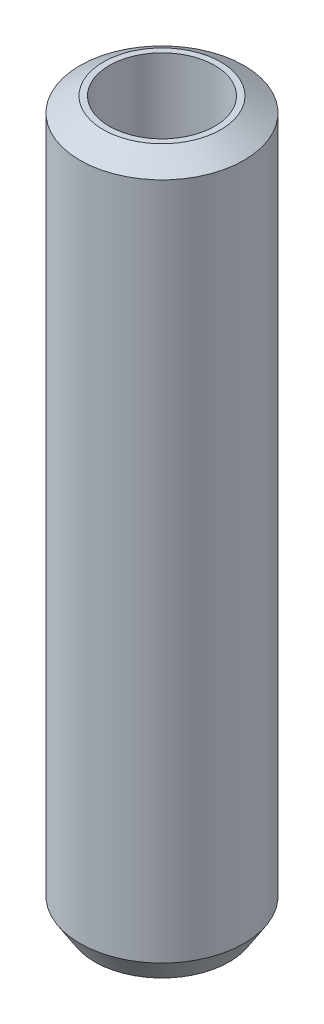
ISO-10303-21;
HEADER;
FILE_DESCRIPTION(('STEP AP214'),'2;1');
FILE_NAME('part.step','',(''),(''),'','','');
FILE_SCHEMA(('AUTOMOTIVE_DESIGN { 1 0 10303 214 1 1 1 1 }'));
ENDSEC;
DATA;
#1=APPLICATION_CONTEXT('core data for automotive mechanical design processes');
#2=APPLICATION_PROTOCOL_DEFINITION('international standard','automotive_design',2000,#1);
#3=PRODUCT_CONTEXT('',#1,'mechanical');
#4=PRODUCT('Part','Part','',(#3));
#5=PRODUCT_RELATED_PRODUCT_CATEGORY('part','',(#4));
#6=PRODUCT_DEFINITION_FORMATION('','',#4);
#7=PRODUCT_DEFINITION_CONTEXT('part definition',#1,'design');
#8=PRODUCT_DEFINITION('design','',#6,#7);
#9=PRODUCT_DEFINITION_SHAPE('','',#8);
#10=(LENGTH_UNIT() NAMED_UNIT(*) SI_UNIT(.MILLI.,.METRE.));
#11=(NAMED_UNIT(*) PLANE_ANGLE_UNIT() SI_UNIT($,.RADIAN.));
#12=(NAMED_UNIT(*) SI_UNIT($,.STERADIAN.) SOLID_ANGLE_UNIT());
#13=UNCERTAINTY_MEASURE_WITH_UNIT(LENGTH_MEASURE(1.E-05),#10,'distance_accuracy_value','');
#14=(GEOMETRIC_REPRESENTATION_CONTEXT(3) GLOBAL_UNCERTAINTY_ASSIGNED_CONTEXT((#13)) GLOBAL_UNIT_ASSIGNED_CONTEXT((#10,
#11,#12)) REPRESENTATION_CONTEXT('',''));
#15=CARTESIAN_POINT('',(0.,0.,0.));
#16=DIRECTION('',(0.,0.,1.));
#17=DIRECTION('',(1.,0.,0.));
#18=AXIS2_PLACEMENT_3D('',#15,#16,#17);
#19=CARTESIAN_POINT('',(0.,261.867297198453,0.));
#20=DIRECTION('',(0.,-1.,0.));
#21=DIRECTION('',(0.,0.,-1.));
#22=AXIS2_PLACEMENT_3D('',#19,#20,#21);
#23=CYLINDRICAL_SURFACE('',#22,30.);
#24=CARTESIAN_POINT('',(0.,256.470627962024,0.));
#25=DIRECTION('',(0.,1.,0.));
#26=DIRECTION('',(0.,0.,1.));
#27=AXIS2_PLACEMENT_3D('',#24,#25,#26);
#28=CIRCLE('',#27,30.);
#29=CARTESIAN_POINT('',(0.,256.470627962024,30.));
#30=VERTEX_POINT('',#29);
#31=EDGE_CURVE('E50',#30,#30,#28,.F.);
#32=ORIENTED_EDGE('',*,*,#31,.T.);
#33=EDGE_LOOP('',(#32));
#34=FACE_BOUND('',#33,.T.);
#35=CARTESIAN_POINT('',(0.,8.53935347832902,0.));
#36=DIRECTION('',(0.,1.,0.));
#37=DIRECTION('',(0.,0.,1.));
#38=AXIS2_PLACEMENT_3D('',#35,#36,#37);
#39=CIRCLE('',#38,30.);
#40=CARTESIAN_POINT('',(0.,8.53935347832902,30.));
#41=VERTEX_POINT('',#40);
#42=EDGE_CURVE('E51',#41,#41,#39,.T.);
#43=ORIENTED_EDGE('',*,*,#42,.T.);
#44=EDGE_LOOP('',(#43));
#45=FACE_BOUND('',#44,.T.);
#46=ADVANCED_FACE('F39',(#34,#45),#23,.T.);
#47=CARTESIAN_POINT('',(0.,261.867297198453,0.));
#48=DIRECTION('',(0.,1.,0.));
#49=DIRECTION('',(0.,0.,1.));
#50=AXIS2_PLACEMENT_3D('',#47,#48,#49);
#51=PLANE('',#50);
#52=CARTESIAN_POINT('',(0.,261.867297198453,0.));
#53=DIRECTION('',(0.,1.,0.));
#54=DIRECTION('',(0.,0.,1.));
#55=AXIS2_PLACEMENT_3D('',#52,#53,#54);
#56=CIRCLE('',#55,21.460646521671);
#57=CARTESIAN_POINT('',(0.,261.867297198453,21.460646521671));
#58=VERTEX_POINT('',#57);
#59=EDGE_CURVE('E54',#58,#58,#56,.T.);
#60=ORIENTED_EDGE('',*,*,#59,.T.);
#61=EDGE_LOOP('',(#60));
#62=FACE_BOUND('',#61,.T.);
#63=CARTESIAN_POINT('',(0.,261.867297198453,0.));
#64=DIRECTION('',(0.,1.,0.));
#65=DIRECTION('',(0.,0.,1.));
#66=AXIS2_PLACEMENT_3D('',#63,#64,#65);
#67=CIRCLE('',#66,19.2736983943849);
#68=CARTESIAN_POINT('',(0.,261.867297198453,19.2736983943849));
#69=VERTEX_POINT('',#68);
#70=EDGE_CURVE('E58',#69,#69,#67,.T.);
#71=ORIENTED_EDGE('',*,*,#70,.F.);
#72=EDGE_LOOP('',(#71));
#73=FACE_BOUND('',#72,.T.);
#74=ADVANCED_FACE('F69',(#62,#73),#51,.T.);
#75=CARTESIAN_POINT('',(0.,0.,0.));
#76=DIRECTION('',(0.,1.,0.));
#77=DIRECTION('',(0.,0.,1.));
#78=AXIS2_PLACEMENT_3D('',#75,#76,#77);
#79=PLANE('',#78);
#80=CARTESIAN_POINT('',(0.,0.,0.));
#81=DIRECTION('',(0.,1.,0.));
#82=DIRECTION('',(0.,0.,1.));
#83=AXIS2_PLACEMENT_3D('',#80,#81,#82);
#84=CIRCLE('',#83,24.6033307635709);
#85=CARTESIAN_POINT('',(0.,0.,24.6033307635709));
#86=VERTEX_POINT('',#85);
#87=EDGE_CURVE('E10',#86,#86,#84,.F.);
#88=ORIENTED_EDGE('',*,*,#87,.T.);
#89=EDGE_LOOP('',(#88));
#90=FACE_BOUND('',#89,.T.);
#91=CARTESIAN_POINT('',(0.,0.,0.));
#92=DIRECTION('',(0.,1.,0.));
#93=DIRECTION('',(0.,0.,1.));
#94=AXIS2_PLACEMENT_3D('',#91,#92,#93);
#95=CIRCLE('',#94,19.2736983943849);
#96=CARTESIAN_POINT('',(0.,0.,19.2736983943849));
#97=VERTEX_POINT('',#96);
#98=EDGE_CURVE('E63',#97,#97,#95,.T.);
#99=ORIENTED_EDGE('',*,*,#98,.T.);
#100=EDGE_LOOP('',(#99));
#101=FACE_BOUND('',#100,.T.);
#102=ADVANCED_FACE('F75',(#90,#101),#79,.F.);
#103=CARTESIAN_POINT('',(0.,261.867297198453,0.));
#104=DIRECTION('',(0.,-1.,0.));
#105=DIRECTION('',(0.,0.,-1.));
#106=AXIS2_PLACEMENT_3D('',#103,#104,#105);
#107=CYLINDRICAL_SURFACE('',#106,19.2736983943849);
#108=ORIENTED_EDGE('',*,*,#70,.T.);
#109=EDGE_LOOP('',(#108));
#110=FACE_BOUND('',#109,.T.);
#111=ORIENTED_EDGE('',*,*,#98,.F.);
#112=EDGE_LOOP('',(#111));
#113=FACE_BOUND('',#112,.T.);
#114=ADVANCED_FACE('F70',(#110,#113),#107,.F.);
#115=CARTESIAN_POINT('',(0.,261.867297198453,0.));
#116=DIRECTION('',(0.,-1.,0.));
#117=DIRECTION('',(0.,0.,-1.));
#118=AXIS2_PLACEMENT_3D('',#115,#116,#117);
#119=CONICAL_SURFACE('',#118,21.460646521671,1.00719604966318);
#120=ORIENTED_EDGE('',*,*,#31,.F.);
#121=EDGE_LOOP('',(#120));
#122=FACE_BOUND('',#121,.T.);
#123=ORIENTED_EDGE('',*,*,#59,.F.);
#124=EDGE_LOOP('',(#123));
#125=FACE_BOUND('',#124,.T.);
#126=ADVANCED_FACE('F81',(#122,#125),#119,.T.);
#127=CARTESIAN_POINT('',(0.,8.53935347832902,0.));
#128=DIRECTION('',(0.,1.,0.));
#129=DIRECTION('',(0.,0.,1.));
#130=AXIS2_PLACEMENT_3D('',#127,#128,#129);
#131=CONICAL_SURFACE('',#130,30.,0.563600277131714);
#132=ORIENTED_EDGE('',*,*,#87,.F.);
#133=EDGE_LOOP('',(#132));
#134=FACE_BOUND('',#133,.T.);
#135=ORIENTED_EDGE('',*,*,#42,.F.);
#136=EDGE_LOOP('',(#135));
#137=FACE_BOUND('',#136,.T.);
#138=ADVANCED_FACE('F45',(#134,#137),#131,.T.);
#139=CLOSED_SHELL('',(#46,#74,#102,#114,#126,#138));
#140=MANIFOLD_SOLID_BREP('B2',#139);
#141=ADVANCED_BREP_SHAPE_REPRESENTATION('',(#18,#140),#14);
#142=SHAPE_DEFINITION_REPRESENTATION(#9,#141);
ENDSEC;
END-ISO-10303-21;
